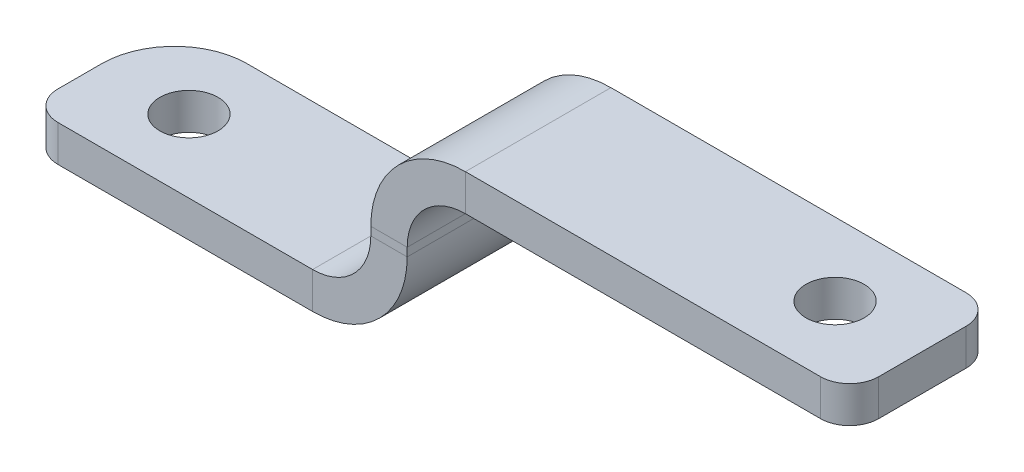
ISO-10303-21;
HEADER;
FILE_DESCRIPTION(('STEP AP214'),'2;1');
FILE_NAME('part.step','',(''),(''),'','','');
FILE_SCHEMA(('AUTOMOTIVE_DESIGN { 1 0 10303 214 1 1 1 1 }'));
ENDSEC;
DATA;
#1=APPLICATION_CONTEXT('core data for automotive mechanical design processes');
#2=APPLICATION_PROTOCOL_DEFINITION('international standard','automotive_design',2000,#1);
#3=PRODUCT_CONTEXT('',#1,'mechanical');
#4=PRODUCT('Part','Part','',(#3));
#5=PRODUCT_RELATED_PRODUCT_CATEGORY('part','',(#4));
#6=PRODUCT_DEFINITION_FORMATION('','',#4);
#7=PRODUCT_DEFINITION_CONTEXT('part definition',#1,'design');
#8=PRODUCT_DEFINITION('design','',#6,#7);
#9=PRODUCT_DEFINITION_SHAPE('','',#8);
#10=(LENGTH_UNIT() NAMED_UNIT(*) SI_UNIT(.MILLI.,.METRE.));
#11=(NAMED_UNIT(*) PLANE_ANGLE_UNIT() SI_UNIT($,.RADIAN.));
#12=(NAMED_UNIT(*) SI_UNIT($,.STERADIAN.) SOLID_ANGLE_UNIT());
#13=UNCERTAINTY_MEASURE_WITH_UNIT(LENGTH_MEASURE(1.E-05),#10,'distance_accuracy_value','');
#14=(GEOMETRIC_REPRESENTATION_CONTEXT(3) GLOBAL_UNCERTAINTY_ASSIGNED_CONTEXT((#13)) GLOBAL_UNIT_ASSIGNED_CONTEXT((#10,
#11,#12)) REPRESENTATION_CONTEXT('',''));
#15=CARTESIAN_POINT('',(0.,0.,0.));
#16=DIRECTION('',(0.,0.,1.));
#17=DIRECTION('',(1.,0.,0.));
#18=AXIS2_PLACEMENT_3D('',#15,#16,#17);
#19=CARTESIAN_POINT('',(52.0000000000001,22.15,-10.));
#20=DIRECTION('',(0.,0.,1.));
#21=DIRECTION('',(1.,0.,0.));
#22=AXIS2_PLACEMENT_3D('',#19,#20,#21);
#23=PLANE('',#22);
#24=DIRECTION('',(-1.,0.,0.));
#25=VECTOR('',#24,1.);
#26=CARTESIAN_POINT('',(52.,14.15,-10.));
#27=LINE('',#26,#25);
#28=CARTESIAN_POINT('',(52.,14.15,-10.));
#29=VERTEX_POINT('',#28);
#30=CARTESIAN_POINT('',(47.,14.15,-10.));
#31=VERTEX_POINT('',#30);
#32=EDGE_CURVE('E208',#29,#31,#27,.T.);
#33=ORIENTED_EDGE('',*,*,#32,.F.);
#34=DIRECTION('',(0.,1.,0.));
#35=VECTOR('',#34,1.);
#36=CARTESIAN_POINT('',(52.0000000000001,22.15,-10.));
#37=LINE('',#36,#35);
#38=CARTESIAN_POINT('',(52.,13.,-10.));
#39=VERTEX_POINT('',#38);
#40=EDGE_CURVE('E224',#39,#29,#37,.T.);
#41=ORIENTED_EDGE('',*,*,#40,.F.);
#42=DIRECTION('',(1.,0.,0.));
#43=VECTOR('',#42,1.);
#44=CARTESIAN_POINT('',(47.,13.,-10.));
#45=LINE('',#44,#43);
#46=CARTESIAN_POINT('',(47.,13.,-10.));
#47=VERTEX_POINT('',#46);
#48=EDGE_CURVE('E215',#47,#39,#45,.T.);
#49=ORIENTED_EDGE('',*,*,#48,.F.);
#50=DIRECTION('',(0.,1.,0.));
#51=VECTOR('',#50,1.);
#52=CARTESIAN_POINT('',(47.0000000000001,22.15,-10.));
#53=LINE('',#52,#51);
#54=EDGE_CURVE('E223',#47,#31,#53,.T.);
#55=ORIENTED_EDGE('',*,*,#54,.T.);
#56=EDGE_LOOP('',(#33,#41,#49,#55));
#57=FACE_BOUND('',#56,.T.);
#58=ADVANCED_FACE('F38',(#57),#23,.F.);
#59=CARTESIAN_POINT('',(52.,4.99999999999998,10.));
#60=DIRECTION('',(0.,0.,-1.));
#61=DIRECTION('',(-1.,0.,0.));
#62=AXIS2_PLACEMENT_3D('',#59,#60,#61);
#63=PLANE('',#62);
#64=DIRECTION('',(-1.,0.,0.));
#65=VECTOR('',#64,1.);
#66=CARTESIAN_POINT('',(52.,14.15,10.));
#67=LINE('',#66,#65);
#68=CARTESIAN_POINT('',(52.,14.15,10.));
#69=VERTEX_POINT('',#68);
#70=CARTESIAN_POINT('',(47.,14.15,10.));
#71=VERTEX_POINT('',#70);
#72=EDGE_CURVE('E201',#69,#71,#67,.T.);
#73=ORIENTED_EDGE('',*,*,#72,.T.);
#74=DIRECTION('',(0.,-1.,0.));
#75=VECTOR('',#74,1.);
#76=CARTESIAN_POINT('',(47.,5.,10.));
#77=LINE('',#76,#75);
#78=CARTESIAN_POINT('',(47.,13.,10.));
#79=VERTEX_POINT('',#78);
#80=EDGE_CURVE('E228',#71,#79,#77,.T.);
#81=ORIENTED_EDGE('',*,*,#80,.T.);
#82=DIRECTION('',(1.,0.,0.));
#83=VECTOR('',#82,1.);
#84=CARTESIAN_POINT('',(47.,13.,10.));
#85=LINE('',#84,#83);
#86=CARTESIAN_POINT('',(52.,13.,10.));
#87=VERTEX_POINT('',#86);
#88=EDGE_CURVE('E211',#79,#87,#85,.T.);
#89=ORIENTED_EDGE('',*,*,#88,.T.);
#90=DIRECTION('',(0.,-1.,0.));
#91=VECTOR('',#90,1.);
#92=CARTESIAN_POINT('',(52.,4.99999999999998,10.));
#93=LINE('',#92,#91);
#94=EDGE_CURVE('E227',#69,#87,#93,.T.);
#95=ORIENTED_EDGE('',*,*,#94,.F.);
#96=EDGE_LOOP('',(#73,#81,#89,#95));
#97=FACE_BOUND('',#96,.T.);
#98=ADVANCED_FACE('F341',(#97),#63,.F.);
#99=CARTESIAN_POINT('',(52.,-1.88603302983006E-13,0.));
#100=DIRECTION('',(-1.,0.,0.));
#101=DIRECTION('',(0.,-1.,0.));
#102=AXIS2_PLACEMENT_3D('',#99,#100,#101);
#103=PLANE('',#102);
#104=DIRECTION('',(0.,0.,1.));
#105=VECTOR('',#104,1.);
#106=CARTESIAN_POINT('',(52.,14.15,10.));
#107=LINE('',#106,#105);
#108=EDGE_CURVE('E205',#69,#29,#107,.F.);
#109=ORIENTED_EDGE('',*,*,#108,.F.);
#110=ORIENTED_EDGE('',*,*,#94,.T.);
#111=DIRECTION('',(0.,0.,1.));
#112=VECTOR('',#111,1.);
#113=CARTESIAN_POINT('',(52.,13.,0.));
#114=LINE('',#113,#112);
#115=EDGE_CURVE('E218',#39,#87,#114,.T.);
#116=ORIENTED_EDGE('',*,*,#115,.F.);
#117=ORIENTED_EDGE('',*,*,#40,.T.);
#118=EDGE_LOOP('',(#109,#110,#116,#117));
#119=FACE_BOUND('',#118,.T.);
#120=ADVANCED_FACE('F356',(#119),#103,.F.);
#121=CARTESIAN_POINT('',(47.,-1.7114589628879E-13,0.));
#122=DIRECTION('',(-1.,0.,0.));
#123=DIRECTION('',(0.,-1.,0.));
#124=AXIS2_PLACEMENT_3D('',#121,#122,#123);
#125=PLANE('',#124);
#126=ORIENTED_EDGE('',*,*,#80,.F.);
#127=DIRECTION('',(0.,0.,1.));
#128=VECTOR('',#127,1.);
#129=CARTESIAN_POINT('',(47.,14.15,10.));
#130=LINE('',#129,#128);
#131=EDGE_CURVE('E157',#71,#31,#130,.F.);
#132=ORIENTED_EDGE('',*,*,#131,.T.);
#133=ORIENTED_EDGE('',*,*,#54,.F.);
#134=DIRECTION('',(0.,0.,-1.));
#135=VECTOR('',#134,1.);
#136=CARTESIAN_POINT('',(47.,13.,10.));
#137=LINE('',#136,#135);
#138=EDGE_CURVE('E213',#79,#47,#137,.T.);
#139=ORIENTED_EDGE('',*,*,#138,.F.);
#140=EDGE_LOOP('',(#126,#132,#133,#139));
#141=FACE_BOUND('',#140,.T.);
#142=ADVANCED_FACE('F344',(#141),#125,.T.);
#143=CARTESIAN_POINT('',(0.,5.,0.));
#144=DIRECTION('',(0.,1.,0.));
#145=DIRECTION('',(0.,0.,1.));
#146=AXIS2_PLACEMENT_3D('',#143,#144,#145);
#147=PLANE('',#146);
#148=CARTESIAN_POINT('',(12.,5.,0.));
#149=DIRECTION('',(0.,1.,0.));
#150=DIRECTION('',(0.,0.,1.));
#151=AXIS2_PLACEMENT_3D('',#148,#149,#150);
#152=CIRCLE('',#151,4.);
#153=CARTESIAN_POINT('',(12.,5.,4.));
#154=VERTEX_POINT('',#153);
#155=EDGE_CURVE('E258',#154,#154,#152,.T.);
#156=ORIENTED_EDGE('',*,*,#155,.F.);
#157=EDGE_LOOP('',(#156));
#158=FACE_BOUND('',#157,.T.);
#159=DIRECTION('',(-1.,0.,0.));
#160=VECTOR('',#159,1.);
#161=CARTESIAN_POINT('',(4.00000000000002,5.,-9.99999999999999));
#162=LINE('',#161,#160);
#163=CARTESIAN_POINT('',(39.,5.,-10.));
#164=VERTEX_POINT('',#163);
#165=CARTESIAN_POINT('',(10.,5.,-9.99999999999999));
#166=VERTEX_POINT('',#165);
#167=EDGE_CURVE('E264',#164,#166,#162,.T.);
#168=ORIENTED_EDGE('',*,*,#167,.T.);
#169=CARTESIAN_POINT('',(10.,5.,0.));
#170=DIRECTION('',(0.,1.,0.));
#171=DIRECTION('',(0.,0.,1.));
#172=AXIS2_PLACEMENT_3D('',#169,#170,#171);
#173=CIRCLE('',#172,10.);
#174=CARTESIAN_POINT('',(0.,5.,0.));
#175=VERTEX_POINT('',#174);
#176=EDGE_CURVE('E11',#166,#175,#173,.T.);
#177=ORIENTED_EDGE('',*,*,#176,.T.);
#178=DIRECTION('',(0.,0.,1.));
#179=VECTOR('',#178,1.);
#180=CARTESIAN_POINT('',(0.,5.,-9.99999999999999));
#181=LINE('',#180,#179);
#182=CARTESIAN_POINT('',(0.,5.,5.99999999999997));
#183=VERTEX_POINT('',#182);
#184=EDGE_CURVE('E266',#175,#183,#181,.T.);
#185=ORIENTED_EDGE('',*,*,#184,.T.);
#186=CARTESIAN_POINT('',(4.,5.,5.99999999999997));
#187=DIRECTION('',(0.,1.,0.));
#188=DIRECTION('',(0.,0.,1.));
#189=AXIS2_PLACEMENT_3D('',#186,#187,#188);
#190=CIRCLE('',#189,4.);
#191=CARTESIAN_POINT('',(4.,5.,9.99999999999997));
#192=VERTEX_POINT('',#191);
#193=EDGE_CURVE('E306',#183,#192,#190,.T.);
#194=ORIENTED_EDGE('',*,*,#193,.T.);
#195=DIRECTION('',(1.,0.,0.));
#196=VECTOR('',#195,1.);
#197=CARTESIAN_POINT('',(4.00000000000003,5.,9.99999999999997));
#198=LINE('',#197,#196);
#199=CARTESIAN_POINT('',(39.,5.,9.99999999999997));
#200=VERTEX_POINT('',#199);
#201=EDGE_CURVE('E269',#192,#200,#198,.T.);
#202=ORIENTED_EDGE('',*,*,#201,.T.);
#203=DIRECTION('',(0.,0.,-1.));
#204=VECTOR('',#203,1.);
#205=CARTESIAN_POINT('',(39.,5.,-10.));
#206=LINE('',#205,#204);
#207=EDGE_CURVE('E247',#164,#200,#206,.F.);
#208=ORIENTED_EDGE('',*,*,#207,.F.);
#209=EDGE_LOOP('',(#168,#177,#185,#194,#202,#208));
#210=FACE_BOUND('',#209,.T.);
#211=ADVANCED_FACE('F326',(#158,#210),#147,.T.);
#212=CARTESIAN_POINT('',(0.,0.,0.));
#213=DIRECTION('',(0.,1.,0.));
#214=DIRECTION('',(0.,0.,1.));
#215=AXIS2_PLACEMENT_3D('',#212,#213,#214);
#216=PLANE('',#215);
#217=CARTESIAN_POINT('',(12.,0.,0.));
#218=DIRECTION('',(0.,1.,0.));
#219=DIRECTION('',(0.,0.,1.));
#220=AXIS2_PLACEMENT_3D('',#217,#218,#219);
#221=CIRCLE('',#220,4.);
#222=CARTESIAN_POINT('',(12.,0.,4.));
#223=VERTEX_POINT('',#222);
#224=EDGE_CURVE('E255',#223,#223,#221,.T.);
#225=ORIENTED_EDGE('',*,*,#224,.T.);
#226=EDGE_LOOP('',(#225));
#227=FACE_BOUND('',#226,.T.);
#228=DIRECTION('',(0.,0.,1.));
#229=VECTOR('',#228,1.);
#230=CARTESIAN_POINT('',(0.,0.,9.99999999999997));
#231=LINE('',#230,#229);
#232=CARTESIAN_POINT('',(0.,0.,0.));
#233=VERTEX_POINT('',#232);
#234=CARTESIAN_POINT('',(0.,0.,5.99999999999997));
#235=VERTEX_POINT('',#234);
#236=EDGE_CURVE('E273',#233,#235,#231,.T.);
#237=ORIENTED_EDGE('',*,*,#236,.F.);
#238=CARTESIAN_POINT('',(10.,0.,0.));
#239=DIRECTION('',(0.,1.,0.));
#240=DIRECTION('',(0.,0.,1.));
#241=AXIS2_PLACEMENT_3D('',#238,#239,#240);
#242=CIRCLE('',#241,10.);
#243=CARTESIAN_POINT('',(10.,0.,-9.99999999999999));
#244=VERTEX_POINT('',#243);
#245=EDGE_CURVE('E60',#233,#244,#242,.F.);
#246=ORIENTED_EDGE('',*,*,#245,.T.);
#247=DIRECTION('',(-1.,0.,0.));
#248=VECTOR('',#247,1.);
#249=CARTESIAN_POINT('',(4.00000000000002,0.,-9.99999999999999));
#250=LINE('',#249,#248);
#251=CARTESIAN_POINT('',(39.,0.,-10.));
#252=VERTEX_POINT('',#251);
#253=EDGE_CURVE('E261',#252,#244,#250,.T.);
#254=ORIENTED_EDGE('',*,*,#253,.F.);
#255=DIRECTION('',(0.,0.,-1.));
#256=VECTOR('',#255,1.);
#257=CARTESIAN_POINT('',(39.,0.,-10.));
#258=LINE('',#257,#256);
#259=CARTESIAN_POINT('',(39.,0.,10.));
#260=VERTEX_POINT('',#259);
#261=EDGE_CURVE('E234',#252,#260,#258,.F.);
#262=ORIENTED_EDGE('',*,*,#261,.T.);
#263=DIRECTION('',(1.,0.,0.));
#264=VECTOR('',#263,1.);
#265=CARTESIAN_POINT('',(4.00000000000003,0.,9.99999999999997));
#266=LINE('',#265,#264);
#267=CARTESIAN_POINT('',(4.,0.,9.99999999999997));
#268=VERTEX_POINT('',#267);
#269=EDGE_CURVE('E267',#268,#260,#266,.T.);
#270=ORIENTED_EDGE('',*,*,#269,.F.);
#271=CARTESIAN_POINT('',(4.,0.,5.99999999999997));
#272=DIRECTION('',(0.,1.,0.));
#273=DIRECTION('',(0.,0.,1.));
#274=AXIS2_PLACEMENT_3D('',#271,#272,#273);
#275=CIRCLE('',#274,4.);
#276=EDGE_CURVE('E300',#268,#235,#275,.F.);
#277=ORIENTED_EDGE('',*,*,#276,.T.);
#278=EDGE_LOOP('',(#237,#246,#254,#262,#270,#277));
#279=FACE_BOUND('',#278,.T.);
#280=ADVANCED_FACE('F317',(#227,#279),#216,.F.);
#281=CARTESIAN_POINT('',(4.00000000000002,5.,-9.99999999999999));
#282=DIRECTION('',(0.,0.,1.));
#283=DIRECTION('',(1.,0.,0.));
#284=AXIS2_PLACEMENT_3D('',#281,#282,#283);
#285=PLANE('',#284);
#286=ORIENTED_EDGE('',*,*,#253,.T.);
#287=DIRECTION('',(0.,-1.,0.));
#288=VECTOR('',#287,1.);
#289=CARTESIAN_POINT('',(10.,5.,-9.99999999999999));
#290=LINE('',#289,#288);
#291=EDGE_CURVE('E46',#244,#166,#290,.F.);
#292=ORIENTED_EDGE('',*,*,#291,.T.);
#293=ORIENTED_EDGE('',*,*,#167,.F.);
#294=DIRECTION('',(0.,-1.,0.));
#295=VECTOR('',#294,1.);
#296=CARTESIAN_POINT('',(39.,5.,-10.));
#297=LINE('',#296,#295);
#298=EDGE_CURVE('E241',#164,#252,#297,.T.);
#299=ORIENTED_EDGE('',*,*,#298,.T.);
#300=EDGE_LOOP('',(#286,#292,#293,#299));
#301=FACE_BOUND('',#300,.T.);
#302=ADVANCED_FACE('F360',(#301),#285,.F.);
#303=CARTESIAN_POINT('',(4.00000000000003,5.,9.99999999999997));
#304=DIRECTION('',(0.,0.,-1.));
#305=DIRECTION('',(-1.,0.,0.));
#306=AXIS2_PLACEMENT_3D('',#303,#304,#305);
#307=PLANE('',#306);
#308=ORIENTED_EDGE('',*,*,#201,.F.);
#309=DIRECTION('',(0.,-1.,0.));
#310=VECTOR('',#309,1.);
#311=CARTESIAN_POINT('',(4.,5.,9.99999999999997));
#312=LINE('',#311,#310);
#313=EDGE_CURVE('E297',#192,#268,#312,.T.);
#314=ORIENTED_EDGE('',*,*,#313,.T.);
#315=ORIENTED_EDGE('',*,*,#269,.T.);
#316=DIRECTION('',(0.,-1.,0.));
#317=VECTOR('',#316,1.);
#318=CARTESIAN_POINT('',(39.,5.,10.));
#319=LINE('',#318,#317);
#320=EDGE_CURVE('E252',#200,#260,#319,.T.);
#321=ORIENTED_EDGE('',*,*,#320,.F.);
#322=EDGE_LOOP('',(#308,#314,#315,#321));
#323=FACE_BOUND('',#322,.T.);
#324=ADVANCED_FACE('F329',(#323),#307,.F.);
#325=CARTESIAN_POINT('',(0.,5.,9.99999999999997));
#326=DIRECTION('',(1.,0.,0.));
#327=DIRECTION('',(0.,0.,-1.));
#328=AXIS2_PLACEMENT_3D('',#325,#326,#327);
#329=PLANE('',#328);
#330=ORIENTED_EDGE('',*,*,#184,.F.);
#331=DIRECTION('',(0.,-1.,0.));
#332=VECTOR('',#331,1.);
#333=CARTESIAN_POINT('',(0.,5.,0.));
#334=LINE('',#333,#332);
#335=EDGE_CURVE('E308',#175,#233,#334,.T.);
#336=ORIENTED_EDGE('',*,*,#335,.T.);
#337=ORIENTED_EDGE('',*,*,#236,.T.);
#338=DIRECTION('',(0.,-1.,0.));
#339=VECTOR('',#338,1.);
#340=CARTESIAN_POINT('',(0.,5.,5.99999999999997));
#341=LINE('',#340,#339);
#342=EDGE_CURVE('E303',#235,#183,#341,.F.);
#343=ORIENTED_EDGE('',*,*,#342,.T.);
#344=EDGE_LOOP('',(#330,#336,#337,#343));
#345=FACE_BOUND('',#344,.T.);
#346=ADVANCED_FACE('F314',(#345),#329,.F.);
#347=CARTESIAN_POINT('',(12.,5.,0.));
#348=DIRECTION('',(0.,-1.,0.));
#349=DIRECTION('',(0.,0.,-1.));
#350=AXIS2_PLACEMENT_3D('',#347,#348,#349);
#351=CYLINDRICAL_SURFACE('',#350,4.);
#352=ORIENTED_EDGE('',*,*,#155,.T.);
#353=EDGE_LOOP('',(#352));
#354=FACE_BOUND('',#353,.T.);
#355=ORIENTED_EDGE('',*,*,#224,.F.);
#356=EDGE_LOOP('',(#355));
#357=FACE_BOUND('',#356,.T.);
#358=ADVANCED_FACE('F381',(#354,#357),#351,.F.);
#359=CARTESIAN_POINT('',(39.,13.,10.));
#360=DIRECTION('',(0.,0.,1.));
#361=DIRECTION('',(1.,0.,0.));
#362=AXIS2_PLACEMENT_3D('',#359,#360,#361);
#363=PLANE('',#362);
#364=ORIENTED_EDGE('',*,*,#88,.F.);
#365=CARTESIAN_POINT('',(39.,13.,10.));
#366=DIRECTION('',(0.,0.,-1.));
#367=DIRECTION('',(-1.,0.,0.));
#368=AXIS2_PLACEMENT_3D('',#365,#366,#367);
#369=CIRCLE('',#368,8.);
#370=EDGE_CURVE('E244',#200,#79,#369,.F.);
#371=ORIENTED_EDGE('',*,*,#370,.F.);
#372=ORIENTED_EDGE('',*,*,#320,.T.);
#373=CARTESIAN_POINT('',(39.,13.,10.));
#374=DIRECTION('',(0.,0.,-1.));
#375=DIRECTION('',(-1.,0.,0.));
#376=AXIS2_PLACEMENT_3D('',#373,#374,#375);
#377=CIRCLE('',#376,13.);
#378=EDGE_CURVE('E237',#260,#87,#377,.F.);
#379=ORIENTED_EDGE('',*,*,#378,.T.);
#380=EDGE_LOOP('',(#364,#371,#372,#379));
#381=FACE_BOUND('',#380,.T.);
#382=ADVANCED_FACE('F338',(#381),#363,.T.);
#383=CARTESIAN_POINT('',(39.,13.,-10.));
#384=DIRECTION('',(0.,0.,1.));
#385=DIRECTION('',(1.,0.,0.));
#386=AXIS2_PLACEMENT_3D('',#383,#384,#385);
#387=PLANE('',#386);
#388=CARTESIAN_POINT('',(39.,13.,-10.));
#389=DIRECTION('',(0.,0.,-1.));
#390=DIRECTION('',(-1.,0.,0.));
#391=AXIS2_PLACEMENT_3D('',#388,#389,#390);
#392=CIRCLE('',#391,8.);
#393=EDGE_CURVE('E230',#47,#164,#392,.T.);
#394=ORIENTED_EDGE('',*,*,#393,.F.);
#395=ORIENTED_EDGE('',*,*,#48,.T.);
#396=CARTESIAN_POINT('',(39.,13.,-10.));
#397=DIRECTION('',(0.,0.,-1.));
#398=DIRECTION('',(-1.,0.,0.));
#399=AXIS2_PLACEMENT_3D('',#396,#397,#398);
#400=CIRCLE('',#399,13.);
#401=EDGE_CURVE('E238',#39,#252,#400,.T.);
#402=ORIENTED_EDGE('',*,*,#401,.T.);
#403=ORIENTED_EDGE('',*,*,#298,.F.);
#404=EDGE_LOOP('',(#394,#395,#402,#403));
#405=FACE_BOUND('',#404,.T.);
#406=ADVANCED_FACE('F349',(#405),#387,.F.);
#407=CARTESIAN_POINT('',(39.,13.,-10.));
#408=DIRECTION('',(0.,0.,-1.));
#409=DIRECTION('',(1.,0.,0.));
#410=AXIS2_PLACEMENT_3D('',#407,#408,#409);
#411=CYLINDRICAL_SURFACE('',#410,13.);
#412=ORIENTED_EDGE('',*,*,#261,.F.);
#413=ORIENTED_EDGE('',*,*,#401,.F.);
#414=ORIENTED_EDGE('',*,*,#115,.T.);
#415=ORIENTED_EDGE('',*,*,#378,.F.);
#416=EDGE_LOOP('',(#412,#413,#414,#415));
#417=FACE_BOUND('',#416,.T.);
#418=ADVANCED_FACE('F359',(#417),#411,.T.);
#419=CARTESIAN_POINT('',(39.,13.,-10.));
#420=DIRECTION('',(0.,0.,-1.));
#421=DIRECTION('',(1.,0.,0.));
#422=AXIS2_PLACEMENT_3D('',#419,#420,#421);
#423=CYLINDRICAL_SURFACE('',#422,8.);
#424=ORIENTED_EDGE('',*,*,#207,.T.);
#425=ORIENTED_EDGE('',*,*,#370,.T.);
#426=ORIENTED_EDGE('',*,*,#138,.T.);
#427=ORIENTED_EDGE('',*,*,#393,.T.);
#428=EDGE_LOOP('',(#424,#425,#426,#427));
#429=FACE_BOUND('',#428,.T.);
#430=ADVANCED_FACE('F334',(#429),#423,.F.);
#431=CARTESIAN_POINT('',(60.,14.15,-10.));
#432=DIRECTION('',(0.,0.,-1.));
#433=DIRECTION('',(-1.,0.,0.));
#434=AXIS2_PLACEMENT_3D('',#431,#432,#433);
#435=PLANE('',#434);
#436=DIRECTION('',(0.,1.,0.));
#437=VECTOR('',#436,1.);
#438=CARTESIAN_POINT('',(60.,22.15,-10.));
#439=LINE('',#438,#437);
#440=CARTESIAN_POINT('',(60.,22.15,-10.));
#441=VERTEX_POINT('',#440);
#442=CARTESIAN_POINT('',(60.,27.15,-10.));
#443=VERTEX_POINT('',#442);
#444=EDGE_CURVE('E279',#441,#443,#439,.T.);
#445=ORIENTED_EDGE('',*,*,#444,.F.);
#446=CARTESIAN_POINT('',(60.,14.15,-10.));
#447=DIRECTION('',(0.,0.,1.));
#448=DIRECTION('',(1.,0.,0.));
#449=AXIS2_PLACEMENT_3D('',#446,#447,#448);
#450=CIRCLE('',#449,8.);
#451=EDGE_CURVE('E160',#29,#441,#450,.F.);
#452=ORIENTED_EDGE('',*,*,#451,.F.);
#453=ORIENTED_EDGE('',*,*,#32,.T.);
#454=CARTESIAN_POINT('',(60.,14.15,-10.));
#455=DIRECTION('',(0.,0.,1.));
#456=DIRECTION('',(1.,0.,0.));
#457=AXIS2_PLACEMENT_3D('',#454,#455,#456);
#458=CIRCLE('',#457,13.);
#459=EDGE_CURVE('E200',#31,#443,#458,.F.);
#460=ORIENTED_EDGE('',*,*,#459,.T.);
#461=EDGE_LOOP('',(#445,#452,#453,#460));
#462=FACE_BOUND('',#461,.T.);
#463=ADVANCED_FACE('F378',(#462),#435,.T.);
#464=CARTESIAN_POINT('',(60.,14.15,10.));
#465=DIRECTION('',(0.,0.,-1.));
#466=DIRECTION('',(-1.,0.,0.));
#467=AXIS2_PLACEMENT_3D('',#464,#465,#466);
#468=PLANE('',#467);
#469=CARTESIAN_POINT('',(60.,14.15,10.));
#470=DIRECTION('',(0.,0.,1.));
#471=DIRECTION('',(1.,0.,0.));
#472=AXIS2_PLACEMENT_3D('',#469,#470,#471);
#473=CIRCLE('',#472,8.);
#474=CARTESIAN_POINT('',(60.,22.15,10.));
#475=VERTEX_POINT('',#474);
#476=EDGE_CURVE('E167',#475,#69,#473,.T.);
#477=ORIENTED_EDGE('',*,*,#476,.F.);
#478=DIRECTION('',(0.,1.,0.));
#479=VECTOR('',#478,1.);
#480=CARTESIAN_POINT('',(60.,22.15,10.));
#481=LINE('',#480,#479);
#482=CARTESIAN_POINT('',(60.,27.15,10.));
#483=VERTEX_POINT('',#482);
#484=EDGE_CURVE('E164',#475,#483,#481,.T.);
#485=ORIENTED_EDGE('',*,*,#484,.T.);
#486=CARTESIAN_POINT('',(60.,14.15,10.));
#487=DIRECTION('',(0.,0.,1.));
#488=DIRECTION('',(1.,0.,0.));
#489=AXIS2_PLACEMENT_3D('',#486,#487,#488);
#490=CIRCLE('',#489,13.);
#491=EDGE_CURVE('E150',#483,#71,#490,.T.);
#492=ORIENTED_EDGE('',*,*,#491,.T.);
#493=ORIENTED_EDGE('',*,*,#72,.F.);
#494=EDGE_LOOP('',(#477,#485,#492,#493));
#495=FACE_BOUND('',#494,.T.);
#496=ADVANCED_FACE('F165',(#495),#468,.F.);
#497=CARTESIAN_POINT('',(60.,14.15,10.));
#498=DIRECTION('',(0.,0.,1.));
#499=DIRECTION('',(0.,1.,0.));
#500=AXIS2_PLACEMENT_3D('',#497,#498,#499);
#501=CYLINDRICAL_SURFACE('',#500,13.);
#502=ORIENTED_EDGE('',*,*,#131,.F.);
#503=ORIENTED_EDGE('',*,*,#491,.F.);
#504=DIRECTION('',(0.,0.,-1.));
#505=VECTOR('',#504,1.);
#506=CARTESIAN_POINT('',(60.,27.15,0.));
#507=LINE('',#506,#505);
#508=EDGE_CURVE('E154',#483,#443,#507,.T.);
#509=ORIENTED_EDGE('',*,*,#508,.T.);
#510=ORIENTED_EDGE('',*,*,#459,.F.);
#511=EDGE_LOOP('',(#502,#503,#509,#510));
#512=FACE_BOUND('',#511,.T.);
#513=ADVANCED_FACE('F152',(#512),#501,.T.);
#514=CARTESIAN_POINT('',(60.,14.15,10.));
#515=DIRECTION('',(0.,0.,1.));
#516=DIRECTION('',(0.,1.,0.));
#517=AXIS2_PLACEMENT_3D('',#514,#515,#516);
#518=CYLINDRICAL_SURFACE('',#517,8.);
#519=ORIENTED_EDGE('',*,*,#108,.T.);
#520=ORIENTED_EDGE('',*,*,#451,.T.);
#521=DIRECTION('',(0.,0.,1.));
#522=VECTOR('',#521,1.);
#523=CARTESIAN_POINT('',(60.,22.15,-10.));
#524=LINE('',#523,#522);
#525=EDGE_CURVE('E172',#441,#475,#524,.T.);
#526=ORIENTED_EDGE('',*,*,#525,.T.);
#527=ORIENTED_EDGE('',*,*,#476,.T.);
#528=EDGE_LOOP('',(#519,#520,#526,#527));
#529=FACE_BOUND('',#528,.T.);
#530=ADVANCED_FACE('F445',(#529),#518,.F.);
#531=CARTESIAN_POINT('',(112.81,27.15,10.));
#532=DIRECTION('',(0.,0.,-1.));
#533=DIRECTION('',(-1.,0.,0.));
#534=AXIS2_PLACEMENT_3D('',#531,#532,#533);
#535=PLANE('',#534);
#536=DIRECTION('',(1.,0.,0.));
#537=VECTOR('',#536,1.);
#538=CARTESIAN_POINT('',(112.81,22.15,10.));
#539=LINE('',#538,#537);
#540=CARTESIAN_POINT('',(108.81,22.15,10.));
#541=VERTEX_POINT('',#540);
#542=EDGE_CURVE('E182',#475,#541,#539,.T.);
#543=ORIENTED_EDGE('',*,*,#542,.T.);
#544=DIRECTION('',(0.,-1.,0.));
#545=VECTOR('',#544,1.);
#546=CARTESIAN_POINT('',(108.81,27.15,10.));
#547=LINE('',#546,#545);
#548=CARTESIAN_POINT('',(108.81,27.15,10.));
#549=VERTEX_POINT('',#548);
#550=EDGE_CURVE('E186',#541,#549,#547,.F.);
#551=ORIENTED_EDGE('',*,*,#550,.T.);
#552=DIRECTION('',(1.,0.,0.));
#553=VECTOR('',#552,1.);
#554=CARTESIAN_POINT('',(112.81,27.15,10.));
#555=LINE('',#554,#553);
#556=EDGE_CURVE('E178',#483,#549,#555,.T.);
#557=ORIENTED_EDGE('',*,*,#556,.F.);
#558=ORIENTED_EDGE('',*,*,#484,.F.);
#559=EDGE_LOOP('',(#543,#551,#557,#558));
#560=FACE_BOUND('',#559,.T.);
#561=ADVANCED_FACE('F184',(#560),#535,.F.);
#562=CARTESIAN_POINT('',(52.0000000000001,27.15,-10.));
#563=DIRECTION('',(0.,0.,1.));
#564=DIRECTION('',(1.,0.,0.));
#565=AXIS2_PLACEMENT_3D('',#562,#563,#564);
#566=PLANE('',#565);
#567=DIRECTION('',(-1.,0.,0.));
#568=VECTOR('',#567,1.);
#569=CARTESIAN_POINT('',(52.0000000000001,27.15,-10.));
#570=LINE('',#569,#568);
#571=CARTESIAN_POINT('',(108.81,27.15,-10.));
#572=VERTEX_POINT('',#571);
#573=EDGE_CURVE('E181',#572,#443,#570,.T.);
#574=ORIENTED_EDGE('',*,*,#573,.F.);
#575=DIRECTION('',(0.,-1.,0.));
#576=VECTOR('',#575,1.);
#577=CARTESIAN_POINT('',(108.81,27.15,-10.));
#578=LINE('',#577,#576);
#579=CARTESIAN_POINT('',(108.81,22.15,-10.));
#580=VERTEX_POINT('',#579);
#581=EDGE_CURVE('E271',#572,#580,#578,.T.);
#582=ORIENTED_EDGE('',*,*,#581,.T.);
#583=DIRECTION('',(-1.,0.,0.));
#584=VECTOR('',#583,1.);
#585=CARTESIAN_POINT('',(52.0000000000001,22.15,-10.));
#586=LINE('',#585,#584);
#587=EDGE_CURVE('E188',#580,#441,#586,.T.);
#588=ORIENTED_EDGE('',*,*,#587,.T.);
#589=ORIENTED_EDGE('',*,*,#444,.T.);
#590=EDGE_LOOP('',(#574,#582,#588,#589));
#591=FACE_BOUND('',#590,.T.);
#592=ADVANCED_FACE('F418',(#591),#566,.F.);
#593=CARTESIAN_POINT('',(0.,27.15,0.));
#594=DIRECTION('',(0.,-1.,0.));
#595=DIRECTION('',(1.,0.,0.));
#596=AXIS2_PLACEMENT_3D('',#593,#594,#595);
#597=PLANE('',#596);
#598=CARTESIAN_POINT('',(100.81,27.15,0.));
#599=DIRECTION('',(0.,1.,0.));
#600=DIRECTION('',(-1.,0.,0.));
#601=AXIS2_PLACEMENT_3D('',#598,#599,#600);
#602=CIRCLE('',#601,4.00000000000001);
#603=CARTESIAN_POINT('',(96.8100000000001,27.15,0.));
#604=VERTEX_POINT('',#603);
#605=EDGE_CURVE('E280',#604,#604,#602,.T.);
#606=ORIENTED_EDGE('',*,*,#605,.F.);
#607=EDGE_LOOP('',(#606));
#608=FACE_BOUND('',#607,.T.);
#609=DIRECTION('',(0.,0.,-1.));
#610=VECTOR('',#609,1.);
#611=CARTESIAN_POINT('',(112.81,27.15,-10.));
#612=LINE('',#611,#610);
#613=CARTESIAN_POINT('',(112.81,27.15,6.));
#614=VERTEX_POINT('',#613);
#615=CARTESIAN_POINT('',(112.81,27.15,-6.));
#616=VERTEX_POINT('',#615);
#617=EDGE_CURVE('E187',#614,#616,#612,.T.);
#618=ORIENTED_EDGE('',*,*,#617,.T.);
#619=CARTESIAN_POINT('',(108.81,27.15,-6.));
#620=DIRECTION('',(0.,-1.,0.));
#621=DIRECTION('',(1.,0.,0.));
#622=AXIS2_PLACEMENT_3D('',#619,#620,#621);
#623=CIRCLE('',#622,4.);
#624=EDGE_CURVE('E294',#616,#572,#623,.F.);
#625=ORIENTED_EDGE('',*,*,#624,.T.);
#626=ORIENTED_EDGE('',*,*,#573,.T.);
#627=ORIENTED_EDGE('',*,*,#508,.F.);
#628=ORIENTED_EDGE('',*,*,#556,.T.);
#629=CARTESIAN_POINT('',(108.81,27.15,6.));
#630=DIRECTION('',(0.,-1.,0.));
#631=DIRECTION('',(1.,0.,0.));
#632=AXIS2_PLACEMENT_3D('',#629,#630,#631);
#633=CIRCLE('',#632,4.);
#634=EDGE_CURVE('E292',#549,#614,#633,.F.);
#635=ORIENTED_EDGE('',*,*,#634,.T.);
#636=EDGE_LOOP('',(#618,#625,#626,#627,#628,#635));
#637=FACE_BOUND('',#636,.T.);
#638=ADVANCED_FACE('F177',(#608,#637),#597,.F.);
#639=CARTESIAN_POINT('',(0.,22.15,0.));
#640=DIRECTION('',(0.,-1.,0.));
#641=DIRECTION('',(1.,0.,0.));
#642=AXIS2_PLACEMENT_3D('',#639,#640,#641);
#643=PLANE('',#642);
#644=CARTESIAN_POINT('',(100.81,22.15,0.));
#645=DIRECTION('',(0.,-1.,0.));
#646=DIRECTION('',(1.,0.,0.));
#647=AXIS2_PLACEMENT_3D('',#644,#645,#646);
#648=CIRCLE('',#647,4.00000000000001);
#649=CARTESIAN_POINT('',(104.81,22.15,0.));
#650=VERTEX_POINT('',#649);
#651=EDGE_CURVE('E276',#650,#650,#648,.T.);
#652=ORIENTED_EDGE('',*,*,#651,.F.);
#653=EDGE_LOOP('',(#652));
#654=FACE_BOUND('',#653,.T.);
#655=ORIENTED_EDGE('',*,*,#587,.F.);
#656=CARTESIAN_POINT('',(108.81,22.15,-6.));
#657=DIRECTION('',(0.,-1.,0.));
#658=DIRECTION('',(1.,0.,0.));
#659=AXIS2_PLACEMENT_3D('',#656,#657,#658);
#660=CIRCLE('',#659,4.);
#661=CARTESIAN_POINT('',(112.81,22.15,-6.));
#662=VERTEX_POINT('',#661);
#663=EDGE_CURVE('E285',#580,#662,#660,.T.);
#664=ORIENTED_EDGE('',*,*,#663,.T.);
#665=DIRECTION('',(0.,0.,-1.));
#666=VECTOR('',#665,1.);
#667=CARTESIAN_POINT('',(112.81,22.15,-10.));
#668=LINE('',#667,#666);
#669=CARTESIAN_POINT('',(112.81,22.15,6.));
#670=VERTEX_POINT('',#669);
#671=EDGE_CURVE('E191',#670,#662,#668,.T.);
#672=ORIENTED_EDGE('',*,*,#671,.F.);
#673=CARTESIAN_POINT('',(108.81,22.15,6.));
#674=DIRECTION('',(0.,-1.,0.));
#675=DIRECTION('',(1.,0.,0.));
#676=AXIS2_PLACEMENT_3D('',#673,#674,#675);
#677=CIRCLE('',#676,4.);
#678=EDGE_CURVE('E283',#670,#541,#677,.T.);
#679=ORIENTED_EDGE('',*,*,#678,.T.);
#680=ORIENTED_EDGE('',*,*,#542,.F.);
#681=ORIENTED_EDGE('',*,*,#525,.F.);
#682=EDGE_LOOP('',(#655,#664,#672,#679,#680,#681));
#683=FACE_BOUND('',#682,.T.);
#684=ADVANCED_FACE('F430',(#654,#683),#643,.T.);
#685=CARTESIAN_POINT('',(112.81,27.15,-10.));
#686=DIRECTION('',(-1.,0.,0.));
#687=DIRECTION('',(0.,-1.,0.));
#688=AXIS2_PLACEMENT_3D('',#685,#686,#687);
#689=PLANE('',#688);
#690=ORIENTED_EDGE('',*,*,#671,.T.);
#691=DIRECTION('',(0.,-1.,0.));
#692=VECTOR('',#691,1.);
#693=CARTESIAN_POINT('',(112.81,27.15,-6.));
#694=LINE('',#693,#692);
#695=EDGE_CURVE('E290',#662,#616,#694,.F.);
#696=ORIENTED_EDGE('',*,*,#695,.T.);
#697=ORIENTED_EDGE('',*,*,#617,.F.);
#698=DIRECTION('',(0.,-1.,0.));
#699=VECTOR('',#698,1.);
#700=CARTESIAN_POINT('',(112.81,27.15,6.));
#701=LINE('',#700,#699);
#702=EDGE_CURVE('E287',#614,#670,#701,.T.);
#703=ORIENTED_EDGE('',*,*,#702,.T.);
#704=EDGE_LOOP('',(#690,#696,#697,#703));
#705=FACE_BOUND('',#704,.T.);
#706=ADVANCED_FACE('F412',(#705),#689,.F.);
#707=CARTESIAN_POINT('',(100.81,17.15,0.));
#708=DIRECTION('',(0.,1.,0.));
#709=DIRECTION('',(-1.,0.,0.));
#710=AXIS2_PLACEMENT_3D('',#707,#708,#709);
#711=CYLINDRICAL_SURFACE('',#710,4.00000000000001);
#712=ORIENTED_EDGE('',*,*,#651,.T.);
#713=EDGE_LOOP('',(#712));
#714=FACE_BOUND('',#713,.T.);
#715=ORIENTED_EDGE('',*,*,#605,.T.);
#716=EDGE_LOOP('',(#715));
#717=FACE_BOUND('',#716,.T.);
#718=ADVANCED_FACE('F402',(#714,#717),#711,.F.);
#719=CARTESIAN_POINT('',(108.81,27.15,-6.));
#720=DIRECTION('',(0.,-1.,0.));
#721=DIRECTION('',(1.,0.,0.));
#722=AXIS2_PLACEMENT_3D('',#719,#720,#721);
#723=CYLINDRICAL_SURFACE('',#722,4.);
#724=ORIENTED_EDGE('',*,*,#624,.F.);
#725=ORIENTED_EDGE('',*,*,#695,.F.);
#726=ORIENTED_EDGE('',*,*,#663,.F.);
#727=ORIENTED_EDGE('',*,*,#581,.F.);
#728=EDGE_LOOP('',(#724,#725,#726,#727));
#729=FACE_BOUND('',#728,.T.);
#730=ADVANCED_FACE('F399',(#729),#723,.T.);
#731=CARTESIAN_POINT('',(108.81,27.15,6.));
#732=DIRECTION('',(0.,-1.,0.));
#733=DIRECTION('',(1.,0.,0.));
#734=AXIS2_PLACEMENT_3D('',#731,#732,#733);
#735=CYLINDRICAL_SURFACE('',#734,4.);
#736=ORIENTED_EDGE('',*,*,#634,.F.);
#737=ORIENTED_EDGE('',*,*,#550,.F.);
#738=ORIENTED_EDGE('',*,*,#678,.F.);
#739=ORIENTED_EDGE('',*,*,#702,.F.);
#740=EDGE_LOOP('',(#736,#737,#738,#739));
#741=FACE_BOUND('',#740,.T.);
#742=ADVANCED_FACE('F365',(#741),#735,.T.);
#743=CARTESIAN_POINT('',(4.,5.,5.99999999999997));
#744=DIRECTION('',(0.,-1.,0.));
#745=DIRECTION('',(0.,0.,-1.));
#746=AXIS2_PLACEMENT_3D('',#743,#744,#745);
#747=CYLINDRICAL_SURFACE('',#746,4.);
#748=ORIENTED_EDGE('',*,*,#193,.F.);
#749=ORIENTED_EDGE('',*,*,#342,.F.);
#750=ORIENTED_EDGE('',*,*,#276,.F.);
#751=ORIENTED_EDGE('',*,*,#313,.F.);
#752=EDGE_LOOP('',(#748,#749,#750,#751));
#753=FACE_BOUND('',#752,.T.);
#754=ADVANCED_FACE('F323',(#753),#747,.T.);
#755=CARTESIAN_POINT('',(10.,5.,0.));
#756=DIRECTION('',(0.,-1.,0.));
#757=DIRECTION('',(0.,0.,-1.));
#758=AXIS2_PLACEMENT_3D('',#755,#756,#757);
#759=CYLINDRICAL_SURFACE('',#758,10.);
#760=ORIENTED_EDGE('',*,*,#176,.F.);
#761=ORIENTED_EDGE('',*,*,#291,.F.);
#762=ORIENTED_EDGE('',*,*,#245,.F.);
#763=ORIENTED_EDGE('',*,*,#335,.F.);
#764=EDGE_LOOP('',(#760,#761,#762,#763));
#765=FACE_BOUND('',#764,.T.);
#766=ADVANCED_FACE('F40',(#765),#759,.T.);
#767=CLOSED_SHELL('',(#58,#98,#120,#142,#211,#280,#302,#324,#346,#358,#382,#406,#418,#430,#463,
#496,#513,#530,#561,#592,#638,#684,#706,#718,#730,#742,#754,#766));
#768=MANIFOLD_SOLID_BREP('B2',#767);
#769=ADVANCED_BREP_SHAPE_REPRESENTATION('',(#18,#768),#14);
#770=SHAPE_DEFINITION_REPRESENTATION(#9,#769);
ENDSEC;
END-ISO-10303-21;
